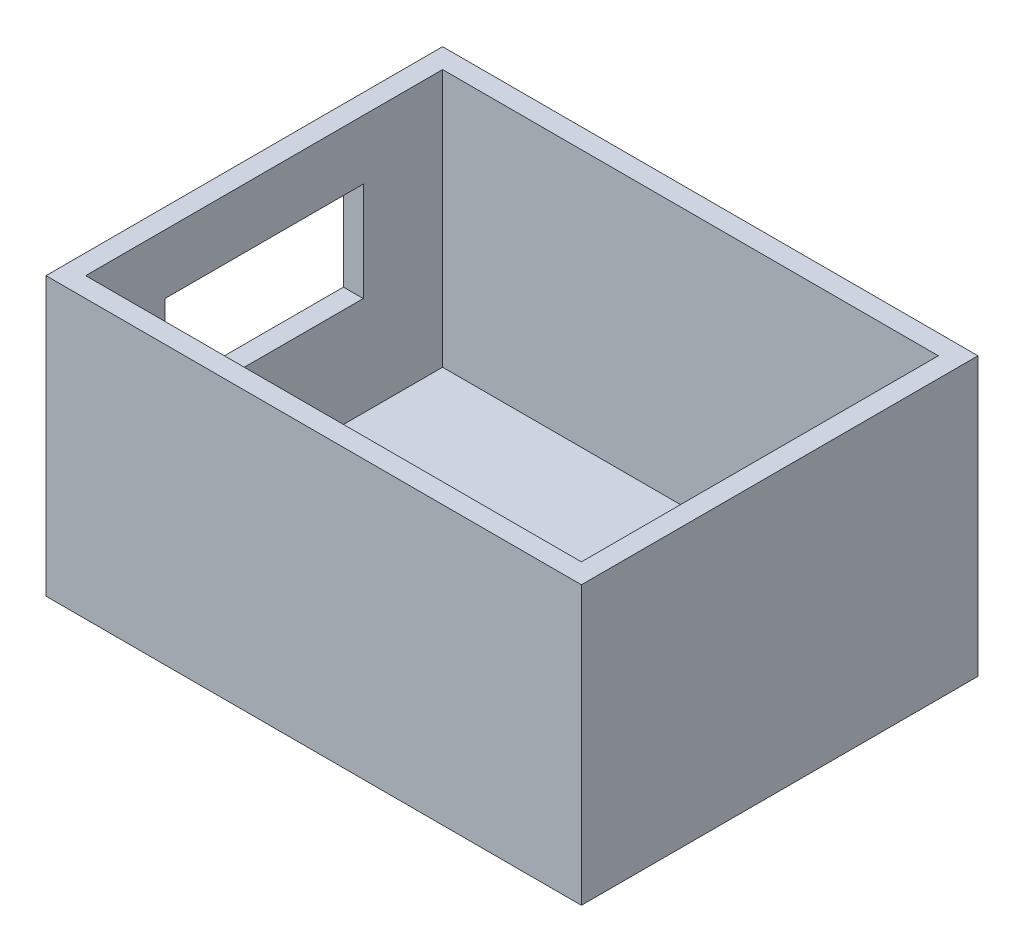
ISO-10303-21;
HEADER;
FILE_DESCRIPTION(('STEP AP214'),'2;1');
FILE_NAME('part.step','',(''),(''),'','','');
FILE_SCHEMA(('AUTOMOTIVE_DESIGN { 1 0 10303 214 1 1 1 1 }'));
ENDSEC;
DATA;
#1=APPLICATION_CONTEXT('core data for automotive mechanical design processes');
#2=APPLICATION_PROTOCOL_DEFINITION('international standard','automotive_design',2000,#1);
#3=PRODUCT_CONTEXT('',#1,'mechanical');
#4=PRODUCT('Part','Part','',(#3));
#5=PRODUCT_RELATED_PRODUCT_CATEGORY('part','',(#4));
#6=PRODUCT_DEFINITION_FORMATION('','',#4);
#7=PRODUCT_DEFINITION_CONTEXT('part definition',#1,'design');
#8=PRODUCT_DEFINITION('design','',#6,#7);
#9=PRODUCT_DEFINITION_SHAPE('','',#8);
#10=(LENGTH_UNIT() NAMED_UNIT(*) SI_UNIT(.MILLI.,.METRE.));
#11=(NAMED_UNIT(*) PLANE_ANGLE_UNIT() SI_UNIT($,.RADIAN.));
#12=(NAMED_UNIT(*) SI_UNIT($,.STERADIAN.) SOLID_ANGLE_UNIT());
#13=UNCERTAINTY_MEASURE_WITH_UNIT(LENGTH_MEASURE(1.E-05),#10,'distance_accuracy_value','');
#14=(GEOMETRIC_REPRESENTATION_CONTEXT(3) GLOBAL_UNCERTAINTY_ASSIGNED_CONTEXT((#13)) GLOBAL_UNIT_ASSIGNED_CONTEXT((#10,
#11,#12)) REPRESENTATION_CONTEXT('',''));
#15=CARTESIAN_POINT('',(0.,0.,0.));
#16=DIRECTION('',(0.,0.,1.));
#17=DIRECTION('',(1.,0.,0.));
#18=AXIS2_PLACEMENT_3D('',#15,#16,#17);
#19=CARTESIAN_POINT('',(-1.,14.,1.));
#20=DIRECTION('',(0.,0.,-1.));
#21=DIRECTION('',(-1.,0.,0.));
#22=AXIS2_PLACEMENT_3D('',#19,#20,#21);
#23=PLANE('',#22);
#24=DIRECTION('',(1.,0.,0.));
#25=VECTOR('',#24,1.);
#26=CARTESIAN_POINT('',(-1.,0.,1.));
#27=LINE('',#26,#25);
#28=CARTESIAN_POINT('',(-1.,0.,1.));
#29=VERTEX_POINT('',#28);
#30=CARTESIAN_POINT('',(26.,0.,1.));
#31=VERTEX_POINT('',#30);
#32=EDGE_CURVE('E235',#29,#31,#27,.T.);
#33=ORIENTED_EDGE('',*,*,#32,.T.);
#34=DIRECTION('',(0.,-1.,0.));
#35=VECTOR('',#34,1.);
#36=CARTESIAN_POINT('',(26.,14.,1.));
#37=LINE('',#36,#35);
#38=CARTESIAN_POINT('',(26.,14.,1.));
#39=VERTEX_POINT('',#38);
#40=EDGE_CURVE('E12',#39,#31,#37,.T.);
#41=ORIENTED_EDGE('',*,*,#40,.F.);
#42=DIRECTION('',(1.,0.,0.));
#43=VECTOR('',#42,1.);
#44=CARTESIAN_POINT('',(-1.,14.,1.));
#45=LINE('',#44,#43);
#46=CARTESIAN_POINT('',(-1.,14.,1.));
#47=VERTEX_POINT('',#46);
#48=EDGE_CURVE('E246',#47,#39,#45,.T.);
#49=ORIENTED_EDGE('',*,*,#48,.F.);
#50=DIRECTION('',(0.,-1.,0.));
#51=VECTOR('',#50,1.);
#52=CARTESIAN_POINT('',(-1.,14.,1.));
#53=LINE('',#52,#51);
#54=EDGE_CURVE('E262',#47,#29,#53,.T.);
#55=ORIENTED_EDGE('',*,*,#54,.T.);
#56=EDGE_LOOP('',(#33,#41,#49,#55));
#57=FACE_BOUND('',#56,.T.);
#58=ADVANCED_FACE('F65',(#57),#23,.F.);
#59=CARTESIAN_POINT('',(26.,14.,1.));
#60=DIRECTION('',(-1.,0.,0.));
#61=DIRECTION('',(0.,0.,1.));
#62=AXIS2_PLACEMENT_3D('',#59,#60,#61);
#63=PLANE('',#62);
#64=DIRECTION('',(0.,0.,-1.));
#65=VECTOR('',#64,1.);
#66=CARTESIAN_POINT('',(26.,0.,1.));
#67=LINE('',#66,#65);
#68=CARTESIAN_POINT('',(26.,0.,-19.));
#69=VERTEX_POINT('',#68);
#70=EDGE_CURVE('E266',#31,#69,#67,.T.);
#71=ORIENTED_EDGE('',*,*,#70,.T.);
#72=DIRECTION('',(0.,-1.,0.));
#73=VECTOR('',#72,1.);
#74=CARTESIAN_POINT('',(26.,14.,-19.));
#75=LINE('',#74,#73);
#76=CARTESIAN_POINT('',(26.,14.,-19.));
#77=VERTEX_POINT('',#76);
#78=EDGE_CURVE('E73',#77,#69,#75,.T.);
#79=ORIENTED_EDGE('',*,*,#78,.F.);
#80=DIRECTION('',(0.,0.,-1.));
#81=VECTOR('',#80,1.);
#82=CARTESIAN_POINT('',(26.,14.,1.));
#83=LINE('',#82,#81);
#84=EDGE_CURVE('E250',#39,#77,#83,.T.);
#85=ORIENTED_EDGE('',*,*,#84,.F.);
#86=ORIENTED_EDGE('',*,*,#40,.T.);
#87=EDGE_LOOP('',(#71,#79,#85,#86));
#88=FACE_BOUND('',#87,.T.);
#89=ADVANCED_FACE('F288',(#88),#63,.F.);
#90=CARTESIAN_POINT('',(-1.,14.,-19.));
#91=DIRECTION('',(0.,0.,-1.));
#92=DIRECTION('',(-1.,0.,0.));
#93=AXIS2_PLACEMENT_3D('',#90,#91,#92);
#94=PLANE('',#93);
#95=DIRECTION('',(1.,0.,0.));
#96=VECTOR('',#95,1.);
#97=CARTESIAN_POINT('',(-1.,0.,-19.));
#98=LINE('',#97,#96);
#99=CARTESIAN_POINT('',(-1.,0.,-19.));
#100=VERTEX_POINT('',#99);
#101=EDGE_CURVE('E270',#100,#69,#98,.T.);
#102=ORIENTED_EDGE('',*,*,#101,.F.);
#103=DIRECTION('',(0.,-1.,0.));
#104=VECTOR('',#103,1.);
#105=CARTESIAN_POINT('',(-1.,14.,-19.));
#106=LINE('',#105,#104);
#107=CARTESIAN_POINT('',(-1.,14.,-19.));
#108=VERTEX_POINT('',#107);
#109=EDGE_CURVE('E279',#108,#100,#106,.T.);
#110=ORIENTED_EDGE('',*,*,#109,.F.);
#111=DIRECTION('',(1.,0.,0.));
#112=VECTOR('',#111,1.);
#113=CARTESIAN_POINT('',(-1.,14.,-19.));
#114=LINE('',#113,#112);
#115=EDGE_CURVE('E254',#108,#77,#114,.T.);
#116=ORIENTED_EDGE('',*,*,#115,.T.);
#117=ORIENTED_EDGE('',*,*,#78,.T.);
#118=EDGE_LOOP('',(#102,#110,#116,#117));
#119=FACE_BOUND('',#118,.T.);
#120=ADVANCED_FACE('F285',(#119),#94,.T.);
#121=CARTESIAN_POINT('',(-1.,14.,1.));
#122=DIRECTION('',(-1.,0.,0.));
#123=DIRECTION('',(0.,0.,1.));
#124=AXIS2_PLACEMENT_3D('',#121,#122,#123);
#125=PLANE('',#124);
#126=DIRECTION('',(0.,-1.,0.));
#127=VECTOR('',#126,1.);
#128=CARTESIAN_POINT('',(-1.,0.,-14.));
#129=LINE('',#128,#127);
#130=CARTESIAN_POINT('',(-1.,11.,-14.));
#131=VERTEX_POINT('',#130);
#132=CARTESIAN_POINT('',(-1.,6.,-14.));
#133=VERTEX_POINT('',#132);
#134=EDGE_CURVE('E80',#131,#133,#129,.T.);
#135=ORIENTED_EDGE('',*,*,#134,.F.);
#136=DIRECTION('',(0.,0.,1.));
#137=VECTOR('',#136,1.);
#138=CARTESIAN_POINT('',(-1.,11.,0.));
#139=LINE('',#138,#137);
#140=CARTESIAN_POINT('',(-1.,11.,-4.));
#141=VERTEX_POINT('',#140);
#142=EDGE_CURVE('E173',#131,#141,#139,.T.);
#143=ORIENTED_EDGE('',*,*,#142,.T.);
#144=DIRECTION('',(0.,-1.,0.));
#145=VECTOR('',#144,1.);
#146=CARTESIAN_POINT('',(-1.,0.,-4.));
#147=LINE('',#146,#145);
#148=CARTESIAN_POINT('',(-1.,6.,-4.));
#149=VERTEX_POINT('',#148);
#150=EDGE_CURVE('E177',#141,#149,#147,.T.);
#151=ORIENTED_EDGE('',*,*,#150,.T.);
#152=DIRECTION('',(0.,0.,1.));
#153=VECTOR('',#152,1.);
#154=CARTESIAN_POINT('',(-1.,6.,0.));
#155=LINE('',#154,#153);
#156=EDGE_CURVE('E186',#133,#149,#155,.T.);
#157=ORIENTED_EDGE('',*,*,#156,.F.);
#158=EDGE_LOOP('',(#135,#143,#151,#157));
#159=FACE_BOUND('',#158,.T.);
#160=DIRECTION('',(0.,0.,-1.));
#161=VECTOR('',#160,1.);
#162=CARTESIAN_POINT('',(-1.,0.,1.));
#163=LINE('',#162,#161);
#164=EDGE_CURVE('E251',#29,#100,#163,.T.);
#165=ORIENTED_EDGE('',*,*,#164,.F.);
#166=ORIENTED_EDGE('',*,*,#54,.F.);
#167=DIRECTION('',(0.,0.,-1.));
#168=VECTOR('',#167,1.);
#169=CARTESIAN_POINT('',(-1.,14.,1.));
#170=LINE('',#169,#168);
#171=EDGE_CURVE('E258',#47,#108,#170,.T.);
#172=ORIENTED_EDGE('',*,*,#171,.T.);
#173=ORIENTED_EDGE('',*,*,#109,.T.);
#174=EDGE_LOOP('',(#165,#166,#172,#173));
#175=FACE_BOUND('',#174,.T.);
#176=ADVANCED_FACE('F295',(#159,#175),#125,.T.);
#177=CARTESIAN_POINT('',(0.,14.,0.));
#178=DIRECTION('',(0.,1.,0.));
#179=DIRECTION('',(0.,0.,1.));
#180=AXIS2_PLACEMENT_3D('',#177,#178,#179);
#181=PLANE('',#180);
#182=DIRECTION('',(1.,0.,0.));
#183=VECTOR('',#182,1.);
#184=CARTESIAN_POINT('',(0.,14.,-18.));
#185=LINE('',#184,#183);
#186=CARTESIAN_POINT('',(0.,14.,-18.));
#187=VERTEX_POINT('',#186);
#188=CARTESIAN_POINT('',(25.,14.,-18.));
#189=VERTEX_POINT('',#188);
#190=EDGE_CURVE('E215',#187,#189,#185,.T.);
#191=ORIENTED_EDGE('',*,*,#190,.T.);
#192=DIRECTION('',(0.,0.,-1.));
#193=VECTOR('',#192,1.);
#194=CARTESIAN_POINT('',(25.,14.,0.));
#195=LINE('',#194,#193);
#196=CARTESIAN_POINT('',(25.,14.,0.));
#197=VERTEX_POINT('',#196);
#198=EDGE_CURVE('E219',#197,#189,#195,.T.);
#199=ORIENTED_EDGE('',*,*,#198,.F.);
#200=DIRECTION('',(1.,0.,0.));
#201=VECTOR('',#200,1.);
#202=CARTESIAN_POINT('',(0.,14.,0.));
#203=LINE('',#202,#201);
#204=CARTESIAN_POINT('',(0.,14.,0.));
#205=VERTEX_POINT('',#204);
#206=EDGE_CURVE('E222',#205,#197,#203,.T.);
#207=ORIENTED_EDGE('',*,*,#206,.F.);
#208=DIRECTION('',(0.,0.,-1.));
#209=VECTOR('',#208,1.);
#210=CARTESIAN_POINT('',(0.,14.,0.));
#211=LINE('',#210,#209);
#212=EDGE_CURVE('E226',#205,#187,#211,.T.);
#213=ORIENTED_EDGE('',*,*,#212,.T.);
#214=EDGE_LOOP('',(#191,#199,#207,#213));
#215=FACE_BOUND('',#214,.T.);
#216=ORIENTED_EDGE('',*,*,#48,.T.);
#217=ORIENTED_EDGE('',*,*,#84,.T.);
#218=ORIENTED_EDGE('',*,*,#115,.F.);
#219=ORIENTED_EDGE('',*,*,#171,.F.);
#220=EDGE_LOOP('',(#216,#217,#218,#219));
#221=FACE_BOUND('',#220,.T.);
#222=ADVANCED_FACE('F299',(#215,#221),#181,.T.);
#223=CARTESIAN_POINT('',(0.,0.,0.));
#224=DIRECTION('',(0.,1.,0.));
#225=DIRECTION('',(0.,0.,1.));
#226=AXIS2_PLACEMENT_3D('',#223,#224,#225);
#227=PLANE('',#226);
#228=ORIENTED_EDGE('',*,*,#32,.F.);
#229=ORIENTED_EDGE('',*,*,#164,.T.);
#230=ORIENTED_EDGE('',*,*,#101,.T.);
#231=ORIENTED_EDGE('',*,*,#70,.F.);
#232=EDGE_LOOP('',(#228,#229,#230,#231));
#233=FACE_BOUND('',#232,.T.);
#234=ADVANCED_FACE('F292',(#233),#227,.F.);
#235=CARTESIAN_POINT('',(0.,14.,-18.));
#236=DIRECTION('',(0.,0.,-1.));
#237=DIRECTION('',(-1.,0.,0.));
#238=AXIS2_PLACEMENT_3D('',#235,#236,#237);
#239=PLANE('',#238);
#240=DIRECTION('',(0.,-1.,0.));
#241=VECTOR('',#240,1.);
#242=CARTESIAN_POINT('',(0.,14.,-18.));
#243=LINE('',#242,#241);
#244=CARTESIAN_POINT('',(0.,0.999999999999999,-18.));
#245=VERTEX_POINT('',#244);
#246=EDGE_CURVE('E231',#187,#245,#243,.T.);
#247=ORIENTED_EDGE('',*,*,#246,.T.);
#248=DIRECTION('',(1.,0.,0.));
#249=VECTOR('',#248,1.);
#250=CARTESIAN_POINT('',(0.,1.,-18.));
#251=LINE('',#250,#249);
#252=CARTESIAN_POINT('',(25.,1.,-18.));
#253=VERTEX_POINT('',#252);
#254=EDGE_CURVE('E208',#245,#253,#251,.T.);
#255=ORIENTED_EDGE('',*,*,#254,.T.);
#256=DIRECTION('',(0.,-1.,0.));
#257=VECTOR('',#256,1.);
#258=CARTESIAN_POINT('',(25.,14.,-18.));
#259=LINE('',#258,#257);
#260=EDGE_CURVE('E230',#189,#253,#259,.T.);
#261=ORIENTED_EDGE('',*,*,#260,.F.);
#262=ORIENTED_EDGE('',*,*,#190,.F.);
#263=EDGE_LOOP('',(#247,#255,#261,#262));
#264=FACE_BOUND('',#263,.T.);
#265=ADVANCED_FACE('F315',(#264),#239,.F.);
#266=CARTESIAN_POINT('',(0.,14.,0.));
#267=DIRECTION('',(-1.,0.,0.));
#268=DIRECTION('',(0.,0.,1.));
#269=AXIS2_PLACEMENT_3D('',#266,#267,#268);
#270=PLANE('',#269);
#271=DIRECTION('',(0.,0.,1.));
#272=VECTOR('',#271,1.);
#273=CARTESIAN_POINT('',(0.,11.,0.));
#274=LINE('',#273,#272);
#275=CARTESIAN_POINT('',(0.,11.,-14.));
#276=VERTEX_POINT('',#275);
#277=CARTESIAN_POINT('',(0.,11.,-4.));
#278=VERTEX_POINT('',#277);
#279=EDGE_CURVE('E160',#276,#278,#274,.T.);
#280=ORIENTED_EDGE('',*,*,#279,.F.);
#281=DIRECTION('',(0.,-1.,0.));
#282=VECTOR('',#281,1.);
#283=CARTESIAN_POINT('',(0.,0.,-14.));
#284=LINE('',#283,#282);
#285=CARTESIAN_POINT('',(0.,6.,-14.));
#286=VERTEX_POINT('',#285);
#287=EDGE_CURVE('E156',#276,#286,#284,.T.);
#288=ORIENTED_EDGE('',*,*,#287,.T.);
#289=DIRECTION('',(0.,0.,1.));
#290=VECTOR('',#289,1.);
#291=CARTESIAN_POINT('',(0.,6.,0.));
#292=LINE('',#291,#290);
#293=CARTESIAN_POINT('',(0.,6.,-4.));
#294=VERTEX_POINT('',#293);
#295=EDGE_CURVE('E163',#286,#294,#292,.T.);
#296=ORIENTED_EDGE('',*,*,#295,.T.);
#297=DIRECTION('',(0.,-1.,0.));
#298=VECTOR('',#297,1.);
#299=CARTESIAN_POINT('',(0.,0.,-4.));
#300=LINE('',#299,#298);
#301=EDGE_CURVE('E168',#278,#294,#300,.T.);
#302=ORIENTED_EDGE('',*,*,#301,.F.);
#303=EDGE_LOOP('',(#280,#288,#296,#302));
#304=FACE_BOUND('',#303,.T.);
#305=DIRECTION('',(0.,-1.,0.));
#306=VECTOR('',#305,1.);
#307=CARTESIAN_POINT('',(0.,14.,0.));
#308=LINE('',#307,#306);
#309=CARTESIAN_POINT('',(0.,0.999999999999999,0.));
#310=VERTEX_POINT('',#309);
#311=EDGE_CURVE('E236',#205,#310,#308,.T.);
#312=ORIENTED_EDGE('',*,*,#311,.T.);
#313=DIRECTION('',(0.,0.,-1.));
#314=VECTOR('',#313,1.);
#315=CARTESIAN_POINT('',(0.,1.,0.));
#316=LINE('',#315,#314);
#317=EDGE_CURVE('E212',#310,#245,#316,.T.);
#318=ORIENTED_EDGE('',*,*,#317,.T.);
#319=ORIENTED_EDGE('',*,*,#246,.F.);
#320=ORIENTED_EDGE('',*,*,#212,.F.);
#321=EDGE_LOOP('',(#312,#318,#319,#320));
#322=FACE_BOUND('',#321,.T.);
#323=ADVANCED_FACE('F170',(#304,#322),#270,.F.);
#324=CARTESIAN_POINT('',(0.,14.,0.));
#325=DIRECTION('',(0.,0.,-1.));
#326=DIRECTION('',(-1.,0.,0.));
#327=AXIS2_PLACEMENT_3D('',#324,#325,#326);
#328=PLANE('',#327);
#329=DIRECTION('',(1.,0.,0.));
#330=VECTOR('',#329,1.);
#331=CARTESIAN_POINT('',(0.,1.,0.));
#332=LINE('',#331,#330);
#333=CARTESIAN_POINT('',(25.,0.999999999999999,0.));
#334=VERTEX_POINT('',#333);
#335=EDGE_CURVE('E195',#310,#334,#332,.T.);
#336=ORIENTED_EDGE('',*,*,#335,.F.);
#337=ORIENTED_EDGE('',*,*,#311,.F.);
#338=ORIENTED_EDGE('',*,*,#206,.T.);
#339=DIRECTION('',(0.,-1.,0.));
#340=VECTOR('',#339,1.);
#341=CARTESIAN_POINT('',(25.,14.,0.));
#342=LINE('',#341,#340);
#343=EDGE_CURVE('E240',#197,#334,#342,.T.);
#344=ORIENTED_EDGE('',*,*,#343,.T.);
#345=EDGE_LOOP('',(#336,#337,#338,#344));
#346=FACE_BOUND('',#345,.T.);
#347=ADVANCED_FACE('F326',(#346),#328,.T.);
#348=CARTESIAN_POINT('',(25.,14.,0.));
#349=DIRECTION('',(-1.,0.,0.));
#350=DIRECTION('',(0.,0.,1.));
#351=AXIS2_PLACEMENT_3D('',#348,#349,#350);
#352=PLANE('',#351);
#353=DIRECTION('',(0.,0.,-1.));
#354=VECTOR('',#353,1.);
#355=CARTESIAN_POINT('',(25.,1.,0.));
#356=LINE('',#355,#354);
#357=EDGE_CURVE('E204',#334,#253,#356,.T.);
#358=ORIENTED_EDGE('',*,*,#357,.F.);
#359=ORIENTED_EDGE('',*,*,#343,.F.);
#360=ORIENTED_EDGE('',*,*,#198,.T.);
#361=ORIENTED_EDGE('',*,*,#260,.T.);
#362=EDGE_LOOP('',(#358,#359,#360,#361));
#363=FACE_BOUND('',#362,.T.);
#364=ADVANCED_FACE('F322',(#363),#352,.T.);
#365=CARTESIAN_POINT('',(0.,1.,0.));
#366=DIRECTION('',(0.,1.,0.));
#367=DIRECTION('',(0.,0.,1.));
#368=AXIS2_PLACEMENT_3D('',#365,#366,#367);
#369=PLANE('',#368);
#370=ORIENTED_EDGE('',*,*,#335,.T.);
#371=ORIENTED_EDGE('',*,*,#357,.T.);
#372=ORIENTED_EDGE('',*,*,#254,.F.);
#373=ORIENTED_EDGE('',*,*,#317,.F.);
#374=EDGE_LOOP('',(#370,#371,#372,#373));
#375=FACE_BOUND('',#374,.T.);
#376=ADVANCED_FACE('F325',(#375),#369,.T.);
#377=CARTESIAN_POINT('',(0.,0.,-14.));
#378=DIRECTION('',(0.,0.,-1.));
#379=DIRECTION('',(-1.,0.,0.));
#380=AXIS2_PLACEMENT_3D('',#377,#378,#379);
#381=PLANE('',#380);
#382=ORIENTED_EDGE('',*,*,#134,.T.);
#383=DIRECTION('',(-1.,0.,0.));
#384=VECTOR('',#383,1.);
#385=CARTESIAN_POINT('',(0.,6.,-14.));
#386=LINE('',#385,#384);
#387=EDGE_CURVE('E153',#286,#133,#386,.T.);
#388=ORIENTED_EDGE('',*,*,#387,.F.);
#389=ORIENTED_EDGE('',*,*,#287,.F.);
#390=DIRECTION('',(-1.,0.,0.));
#391=VECTOR('',#390,1.);
#392=CARTESIAN_POINT('',(0.,11.,-14.));
#393=LINE('',#392,#391);
#394=EDGE_CURVE('E192',#276,#131,#393,.T.);
#395=ORIENTED_EDGE('',*,*,#394,.T.);
#396=EDGE_LOOP('',(#382,#388,#389,#395));
#397=FACE_BOUND('',#396,.T.);
#398=ADVANCED_FACE('F154',(#397),#381,.F.);
#399=CARTESIAN_POINT('',(0.,11.,0.));
#400=DIRECTION('',(0.,-1.,0.));
#401=DIRECTION('',(0.,0.,-1.));
#402=AXIS2_PLACEMENT_3D('',#399,#400,#401);
#403=PLANE('',#402);
#404=ORIENTED_EDGE('',*,*,#142,.F.);
#405=ORIENTED_EDGE('',*,*,#394,.F.);
#406=ORIENTED_EDGE('',*,*,#279,.T.);
#407=DIRECTION('',(-1.,0.,0.));
#408=VECTOR('',#407,1.);
#409=CARTESIAN_POINT('',(0.,11.,-4.));
#410=LINE('',#409,#408);
#411=EDGE_CURVE('E196',#278,#141,#410,.T.);
#412=ORIENTED_EDGE('',*,*,#411,.T.);
#413=EDGE_LOOP('',(#404,#405,#406,#412));
#414=FACE_BOUND('',#413,.T.);
#415=ADVANCED_FACE('F338',(#414),#403,.T.);
#416=CARTESIAN_POINT('',(0.,0.,-4.));
#417=DIRECTION('',(0.,0.,-1.));
#418=DIRECTION('',(-1.,0.,0.));
#419=AXIS2_PLACEMENT_3D('',#416,#417,#418);
#420=PLANE('',#419);
#421=ORIENTED_EDGE('',*,*,#150,.F.);
#422=ORIENTED_EDGE('',*,*,#411,.F.);
#423=ORIENTED_EDGE('',*,*,#301,.T.);
#424=DIRECTION('',(-1.,0.,0.));
#425=VECTOR('',#424,1.);
#426=CARTESIAN_POINT('',(0.,6.,-4.));
#427=LINE('',#426,#425);
#428=EDGE_CURVE('E88',#294,#149,#427,.T.);
#429=ORIENTED_EDGE('',*,*,#428,.T.);
#430=EDGE_LOOP('',(#421,#422,#423,#429));
#431=FACE_BOUND('',#430,.T.);
#432=ADVANCED_FACE('F341',(#431),#420,.T.);
#433=CARTESIAN_POINT('',(0.,6.,0.));
#434=DIRECTION('',(0.,-1.,0.));
#435=DIRECTION('',(0.,0.,-1.));
#436=AXIS2_PLACEMENT_3D('',#433,#434,#435);
#437=PLANE('',#436);
#438=ORIENTED_EDGE('',*,*,#156,.T.);
#439=ORIENTED_EDGE('',*,*,#428,.F.);
#440=ORIENTED_EDGE('',*,*,#295,.F.);
#441=ORIENTED_EDGE('',*,*,#387,.T.);
#442=EDGE_LOOP('',(#438,#439,#440,#441));
#443=FACE_BOUND('',#442,.T.);
#444=ADVANCED_FACE('F164',(#443),#437,.F.);
#445=CLOSED_SHELL('',(#58,#89,#120,#176,#222,#234,#265,#323,#347,#364,#376,#398,#415,#432,#444));
#446=MANIFOLD_SOLID_BREP('B2',#445);
#447=ADVANCED_BREP_SHAPE_REPRESENTATION('',(#18,#446),#14);
#448=SHAPE_DEFINITION_REPRESENTATION(#9,#447);
ENDSEC;
END-ISO-10303-21;
